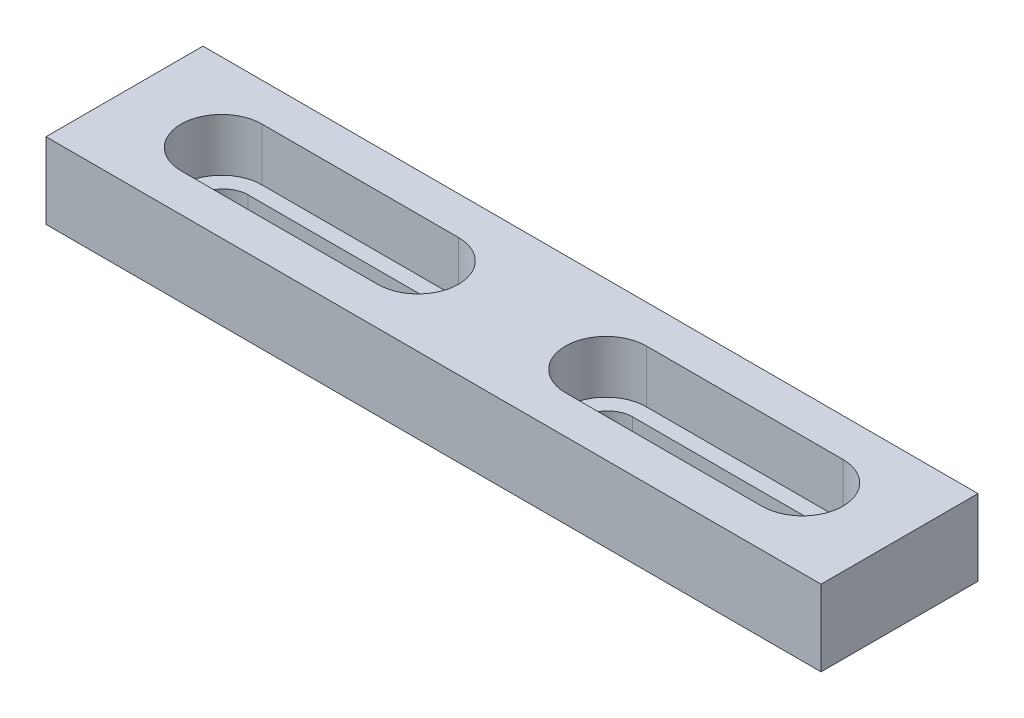
ISO-10303-21;
HEADER;
FILE_DESCRIPTION(('STEP AP214'),'2;1');
FILE_NAME('part.step','',(''),(''),'','','');
FILE_SCHEMA(('AUTOMOTIVE_DESIGN { 1 0 10303 214 1 1 1 1 }'));
ENDSEC;
DATA;
#1=APPLICATION_CONTEXT('core data for automotive mechanical design processes');
#2=APPLICATION_PROTOCOL_DEFINITION('international standard','automotive_design',2000,#1);
#3=PRODUCT_CONTEXT('',#1,'mechanical');
#4=PRODUCT('Part','Part','',(#3));
#5=PRODUCT_RELATED_PRODUCT_CATEGORY('part','',(#4));
#6=PRODUCT_DEFINITION_FORMATION('','',#4);
#7=PRODUCT_DEFINITION_CONTEXT('part definition',#1,'design');
#8=PRODUCT_DEFINITION('design','',#6,#7);
#9=PRODUCT_DEFINITION_SHAPE('','',#8);
#10=(LENGTH_UNIT() NAMED_UNIT(*) SI_UNIT(.MILLI.,.METRE.));
#11=(NAMED_UNIT(*) PLANE_ANGLE_UNIT() SI_UNIT($,.RADIAN.));
#12=(NAMED_UNIT(*) SI_UNIT($,.STERADIAN.) SOLID_ANGLE_UNIT());
#13=UNCERTAINTY_MEASURE_WITH_UNIT(LENGTH_MEASURE(1.E-05),#10,'distance_accuracy_value','');
#14=(GEOMETRIC_REPRESENTATION_CONTEXT(3) GLOBAL_UNCERTAINTY_ASSIGNED_CONTEXT((#13)) GLOBAL_UNIT_ASSIGNED_CONTEXT((#10,
#11,#12)) REPRESENTATION_CONTEXT('',''));
#15=CARTESIAN_POINT('',(0.,0.,0.));
#16=DIRECTION('',(0.,0.,1.));
#17=DIRECTION('',(1.,0.,0.));
#18=AXIS2_PLACEMENT_3D('',#15,#16,#17);
#19=CARTESIAN_POINT('',(12.1249999999999,9.8,1.66190792266419E-13));
#20=DIRECTION('',(0.,-1.,0.));
#21=DIRECTION('',(0.,0.,-1.));
#22=AXIS2_PLACEMENT_3D('',#19,#20,#21);
#23=CYLINDRICAL_SURFACE('',#22,5.225);
#24=CARTESIAN_POINT('',(12.1249999999999,3.,1.66190792266419E-13));
#25=DIRECTION('',(0.,-1.,0.));
#26=DIRECTION('',(0.,0.,-1.));
#27=AXIS2_PLACEMENT_3D('',#24,#25,#26);
#28=CIRCLE('',#27,5.225);
#29=CARTESIAN_POINT('',(12.125,3.,-5.22499999999984));
#30=VERTEX_POINT('',#29);
#31=CARTESIAN_POINT('',(12.1249999999999,3.,5.22500000000017));
#32=VERTEX_POINT('',#31);
#33=EDGE_CURVE('E180',#30,#32,#28,.F.);
#34=ORIENTED_EDGE('',*,*,#33,.F.);
#35=DIRECTION('',(0.,-1.,0.));
#36=VECTOR('',#35,1.);
#37=CARTESIAN_POINT('',(12.125,9.8,-5.22499999999984));
#38=LINE('',#37,#36);
#39=CARTESIAN_POINT('',(12.125,9.8,-5.22499999999984));
#40=VERTEX_POINT('',#39);
#41=EDGE_CURVE('E192',#40,#30,#38,.T.);
#42=ORIENTED_EDGE('',*,*,#41,.F.);
#43=CARTESIAN_POINT('',(12.1249999999999,9.8,1.66190792266419E-13));
#44=DIRECTION('',(0.,1.,0.));
#45=DIRECTION('',(0.,0.,1.));
#46=AXIS2_PLACEMENT_3D('',#43,#44,#45);
#47=CIRCLE('',#46,5.225);
#48=CARTESIAN_POINT('',(12.1249999999999,9.8,5.22500000000017));
#49=VERTEX_POINT('',#48);
#50=EDGE_CURVE('E346',#49,#40,#47,.F.);
#51=ORIENTED_EDGE('',*,*,#50,.F.);
#52=DIRECTION('',(0.,-1.,0.));
#53=VECTOR('',#52,1.);
#54=CARTESIAN_POINT('',(12.1249999999999,9.8,5.22500000000017));
#55=LINE('',#54,#53);
#56=EDGE_CURVE('E194',#49,#32,#55,.T.);
#57=ORIENTED_EDGE('',*,*,#56,.T.);
#58=EDGE_LOOP('',(#34,#42,#51,#57));
#59=FACE_BOUND('',#58,.T.);
#60=ADVANCED_FACE('F41',(#59),#23,.F.);
#61=CARTESIAN_POINT('',(0.,9.8,5.225));
#62=DIRECTION('',(0.,0.,1.));
#63=DIRECTION('',(1.,0.,0.));
#64=AXIS2_PLACEMENT_3D('',#61,#62,#63);
#65=PLANE('',#64);
#66=DIRECTION('',(1.,0.,0.));
#67=VECTOR('',#66,1.);
#68=CARTESIAN_POINT('',(0.,3.,5.225));
#69=LINE('',#68,#67);
#70=CARTESIAN_POINT('',(37.4749999999999,3.,5.22500000000052));
#71=VERTEX_POINT('',#70);
#72=EDGE_CURVE('E340',#32,#71,#69,.T.);
#73=ORIENTED_EDGE('',*,*,#72,.F.);
#74=ORIENTED_EDGE('',*,*,#56,.F.);
#75=DIRECTION('',(-1.,0.,0.));
#76=VECTOR('',#75,1.);
#77=CARTESIAN_POINT('',(0.,9.8,5.225));
#78=LINE('',#77,#76);
#79=CARTESIAN_POINT('',(37.4749999999999,9.8,5.22500000000052));
#80=VERTEX_POINT('',#79);
#81=EDGE_CURVE('E343',#80,#49,#78,.T.);
#82=ORIENTED_EDGE('',*,*,#81,.F.);
#83=DIRECTION('',(0.,-1.,0.));
#84=VECTOR('',#83,1.);
#85=CARTESIAN_POINT('',(37.4749999999999,9.8,5.22500000000052));
#86=LINE('',#85,#84);
#87=EDGE_CURVE('E206',#80,#71,#86,.T.);
#88=ORIENTED_EDGE('',*,*,#87,.T.);
#89=EDGE_LOOP('',(#73,#74,#82,#88));
#90=FACE_BOUND('',#89,.T.);
#91=ADVANCED_FACE('F284',(#90),#65,.F.);
#92=CARTESIAN_POINT('',(37.4749999999999,9.8,5.1364947960281E-13));
#93=DIRECTION('',(0.,-1.,0.));
#94=DIRECTION('',(0.,0.,-1.));
#95=AXIS2_PLACEMENT_3D('',#92,#93,#94);
#96=CYLINDRICAL_SURFACE('',#95,5.225);
#97=CARTESIAN_POINT('',(37.4749999999999,3.,5.1364947960281E-13));
#98=DIRECTION('',(0.,-1.,0.));
#99=DIRECTION('',(0.,0.,-1.));
#100=AXIS2_PLACEMENT_3D('',#97,#98,#99);
#101=CIRCLE('',#100,5.225);
#102=CARTESIAN_POINT('',(37.475,3.,-5.22499999999949));
#103=VERTEX_POINT('',#102);
#104=EDGE_CURVE('E57',#71,#103,#101,.F.);
#105=ORIENTED_EDGE('',*,*,#104,.F.);
#106=ORIENTED_EDGE('',*,*,#87,.F.);
#107=CARTESIAN_POINT('',(37.4749999999999,9.8,5.1364947960281E-13));
#108=DIRECTION('',(0.,1.,0.));
#109=DIRECTION('',(0.,0.,1.));
#110=AXIS2_PLACEMENT_3D('',#107,#108,#109);
#111=CIRCLE('',#110,5.225);
#112=CARTESIAN_POINT('',(37.475,9.8,-5.22499999999949));
#113=VERTEX_POINT('',#112);
#114=EDGE_CURVE('E208',#113,#80,#111,.F.);
#115=ORIENTED_EDGE('',*,*,#114,.F.);
#116=DIRECTION('',(0.,-1.,0.));
#117=VECTOR('',#116,1.);
#118=CARTESIAN_POINT('',(37.475,9.8,-5.22499999999949));
#119=LINE('',#118,#117);
#120=EDGE_CURVE('E202',#113,#103,#119,.T.);
#121=ORIENTED_EDGE('',*,*,#120,.T.);
#122=EDGE_LOOP('',(#105,#106,#115,#121));
#123=FACE_BOUND('',#122,.T.);
#124=ADVANCED_FACE('F289',(#123),#96,.F.);
#125=CARTESIAN_POINT('',(0.,9.8,-5.225));
#126=DIRECTION('',(0.,0.,1.));
#127=DIRECTION('',(1.,0.,0.));
#128=AXIS2_PLACEMENT_3D('',#125,#126,#127);
#129=PLANE('',#128);
#130=ORIENTED_EDGE('',*,*,#41,.T.);
#131=DIRECTION('',(-1.,0.,0.));
#132=VECTOR('',#131,1.);
#133=CARTESIAN_POINT('',(0.,3.,-5.225));
#134=LINE('',#133,#132);
#135=EDGE_CURVE('E176',#103,#30,#134,.T.);
#136=ORIENTED_EDGE('',*,*,#135,.F.);
#137=ORIENTED_EDGE('',*,*,#120,.F.);
#138=DIRECTION('',(-1.,0.,0.));
#139=VECTOR('',#138,1.);
#140=CARTESIAN_POINT('',(0.,9.8,-5.225));
#141=LINE('',#140,#139);
#142=EDGE_CURVE('E200',#113,#40,#141,.T.);
#143=ORIENTED_EDGE('',*,*,#142,.T.);
#144=EDGE_LOOP('',(#130,#136,#137,#143));
#145=FACE_BOUND('',#144,.T.);
#146=ADVANCED_FACE('F198',(#145),#129,.T.);
#147=CARTESIAN_POINT('',(0.,9.8,5.225));
#148=DIRECTION('',(0.,0.,-1.));
#149=DIRECTION('',(-1.,0.,0.));
#150=AXIS2_PLACEMENT_3D('',#147,#148,#149);
#151=PLANE('',#150);
#152=DIRECTION('',(0.,-1.,0.));
#153=VECTOR('',#152,1.);
#154=CARTESIAN_POINT('',(-12.1249999999999,9.8,5.225));
#155=LINE('',#154,#153);
#156=CARTESIAN_POINT('',(-12.1249999999999,9.8,5.225));
#157=VERTEX_POINT('',#156);
#158=CARTESIAN_POINT('',(-12.1249999999999,3.,5.225));
#159=VERTEX_POINT('',#158);
#160=EDGE_CURVE('E238',#157,#159,#155,.T.);
#161=ORIENTED_EDGE('',*,*,#160,.T.);
#162=DIRECTION('',(1.,0.,0.));
#163=VECTOR('',#162,1.);
#164=CARTESIAN_POINT('',(0.,3.,5.225));
#165=LINE('',#164,#163);
#166=CARTESIAN_POINT('',(-37.4749999999999,3.,5.225));
#167=VERTEX_POINT('',#166);
#168=EDGE_CURVE('E418',#167,#159,#165,.T.);
#169=ORIENTED_EDGE('',*,*,#168,.F.);
#170=DIRECTION('',(0.,-1.,0.));
#171=VECTOR('',#170,1.);
#172=CARTESIAN_POINT('',(-37.4749999999999,9.8,5.225));
#173=LINE('',#172,#171);
#174=CARTESIAN_POINT('',(-37.4749999999999,9.8,5.225));
#175=VERTEX_POINT('',#174);
#176=EDGE_CURVE('E365',#175,#167,#173,.T.);
#177=ORIENTED_EDGE('',*,*,#176,.F.);
#178=DIRECTION('',(1.,0.,0.));
#179=VECTOR('',#178,1.);
#180=CARTESIAN_POINT('',(0.,9.8,5.225));
#181=LINE('',#180,#179);
#182=EDGE_CURVE('E217',#175,#157,#181,.T.);
#183=ORIENTED_EDGE('',*,*,#182,.T.);
#184=EDGE_LOOP('',(#161,#169,#177,#183));
#185=FACE_BOUND('',#184,.T.);
#186=ADVANCED_FACE('F328',(#185),#151,.T.);
#187=CARTESIAN_POINT('',(-12.1249999999999,9.8,0.));
#188=DIRECTION('',(0.,-1.,0.));
#189=DIRECTION('',(0.,0.,-1.));
#190=AXIS2_PLACEMENT_3D('',#187,#188,#189);
#191=CYLINDRICAL_SURFACE('',#190,5.225);
#192=DIRECTION('',(0.,-1.,0.));
#193=VECTOR('',#192,1.);
#194=CARTESIAN_POINT('',(-12.1249999999999,9.8,-5.225));
#195=LINE('',#194,#193);
#196=CARTESIAN_POINT('',(-12.1249999999999,9.8,-5.225));
#197=VERTEX_POINT('',#196);
#198=CARTESIAN_POINT('',(-12.1249999999999,3.,-5.225));
#199=VERTEX_POINT('',#198);
#200=EDGE_CURVE('E357',#197,#199,#195,.T.);
#201=ORIENTED_EDGE('',*,*,#200,.T.);
#202=CARTESIAN_POINT('',(-12.1249999999999,3.,0.));
#203=DIRECTION('',(0.,-1.,0.));
#204=DIRECTION('',(0.,0.,-1.));
#205=AXIS2_PLACEMENT_3D('',#202,#203,#204);
#206=CIRCLE('',#205,5.225);
#207=EDGE_CURVE('E385',#159,#199,#206,.F.);
#208=ORIENTED_EDGE('',*,*,#207,.F.);
#209=ORIENTED_EDGE('',*,*,#160,.F.);
#210=CARTESIAN_POINT('',(-12.1249999999999,9.8,0.));
#211=DIRECTION('',(0.,1.,0.));
#212=DIRECTION('',(0.,0.,1.));
#213=AXIS2_PLACEMENT_3D('',#210,#211,#212);
#214=CIRCLE('',#213,5.225);
#215=EDGE_CURVE('E376',#157,#197,#214,.T.);
#216=ORIENTED_EDGE('',*,*,#215,.T.);
#217=EDGE_LOOP('',(#201,#208,#209,#216));
#218=FACE_BOUND('',#217,.T.);
#219=ADVANCED_FACE('F324',(#218),#191,.F.);
#220=CARTESIAN_POINT('',(0.,9.8,-5.225));
#221=DIRECTION('',(0.,0.,-1.));
#222=DIRECTION('',(-1.,0.,0.));
#223=AXIS2_PLACEMENT_3D('',#220,#221,#222);
#224=PLANE('',#223);
#225=DIRECTION('',(-1.,0.,0.));
#226=VECTOR('',#225,1.);
#227=CARTESIAN_POINT('',(0.,3.,-5.225));
#228=LINE('',#227,#226);
#229=CARTESIAN_POINT('',(-37.4749999999999,3.,-5.225));
#230=VERTEX_POINT('',#229);
#231=EDGE_CURVE('E65',#199,#230,#228,.T.);
#232=ORIENTED_EDGE('',*,*,#231,.F.);
#233=ORIENTED_EDGE('',*,*,#200,.F.);
#234=DIRECTION('',(1.,0.,0.));
#235=VECTOR('',#234,1.);
#236=CARTESIAN_POINT('',(0.,9.8,-5.225));
#237=LINE('',#236,#235);
#238=CARTESIAN_POINT('',(-37.4749999999999,9.8,-5.225));
#239=VERTEX_POINT('',#238);
#240=EDGE_CURVE('E372',#239,#197,#237,.T.);
#241=ORIENTED_EDGE('',*,*,#240,.F.);
#242=DIRECTION('',(0.,-1.,0.));
#243=VECTOR('',#242,1.);
#244=CARTESIAN_POINT('',(-37.4749999999999,9.8,-5.225));
#245=LINE('',#244,#243);
#246=EDGE_CURVE('E361',#239,#230,#245,.T.);
#247=ORIENTED_EDGE('',*,*,#246,.T.);
#248=EDGE_LOOP('',(#232,#233,#241,#247));
#249=FACE_BOUND('',#248,.T.);
#250=ADVANCED_FACE('F320',(#249),#224,.F.);
#251=CARTESIAN_POINT('',(-37.4749999999999,9.8,0.));
#252=DIRECTION('',(0.,-1.,0.));
#253=DIRECTION('',(0.,0.,-1.));
#254=AXIS2_PLACEMENT_3D('',#251,#252,#253);
#255=CYLINDRICAL_SURFACE('',#254,5.225);
#256=ORIENTED_EDGE('',*,*,#176,.T.);
#257=CARTESIAN_POINT('',(-37.4749999999999,3.,0.));
#258=DIRECTION('',(0.,-1.,0.));
#259=DIRECTION('',(0.,0.,-1.));
#260=AXIS2_PLACEMENT_3D('',#257,#258,#259);
#261=CIRCLE('',#260,5.225);
#262=EDGE_CURVE('E415',#230,#167,#261,.F.);
#263=ORIENTED_EDGE('',*,*,#262,.F.);
#264=ORIENTED_EDGE('',*,*,#246,.F.);
#265=CARTESIAN_POINT('',(-37.4749999999999,9.8,0.));
#266=DIRECTION('',(0.,1.,0.));
#267=DIRECTION('',(0.,0.,1.));
#268=AXIS2_PLACEMENT_3D('',#265,#266,#267);
#269=CIRCLE('',#268,5.225);
#270=EDGE_CURVE('E369',#239,#175,#269,.T.);
#271=ORIENTED_EDGE('',*,*,#270,.T.);
#272=EDGE_LOOP('',(#256,#263,#264,#271));
#273=FACE_BOUND('',#272,.T.);
#274=ADVANCED_FACE('F296',(#273),#255,.F.);
#275=CARTESIAN_POINT('',(0.,9.8,0.));
#276=DIRECTION('',(0.,-1.,0.));
#277=DIRECTION('',(0.,0.,-1.));
#278=AXIS2_PLACEMENT_3D('',#275,#276,#277);
#279=PLANE('',#278);
#280=DIRECTION('',(0.,0.,-1.));
#281=VECTOR('',#280,1.);
#282=CARTESIAN_POINT('',(50.,9.8,10.125));
#283=LINE('',#282,#281);
#284=CARTESIAN_POINT('',(50.,9.8,10.125));
#285=VERTEX_POINT('',#284);
#286=CARTESIAN_POINT('',(50.,9.8,-10.125));
#287=VERTEX_POINT('',#286);
#288=EDGE_CURVE('E218',#285,#287,#283,.T.);
#289=ORIENTED_EDGE('',*,*,#288,.T.);
#290=DIRECTION('',(-1.,0.,0.));
#291=VECTOR('',#290,1.);
#292=CARTESIAN_POINT('',(-49.9999999999999,9.8,-10.125));
#293=LINE('',#292,#291);
#294=CARTESIAN_POINT('',(-49.9999999999999,9.8,-10.125));
#295=VERTEX_POINT('',#294);
#296=EDGE_CURVE('E222',#287,#295,#293,.T.);
#297=ORIENTED_EDGE('',*,*,#296,.T.);
#298=DIRECTION('',(0.,0.,1.));
#299=VECTOR('',#298,1.);
#300=CARTESIAN_POINT('',(-49.9999999999999,9.8,10.125));
#301=LINE('',#300,#299);
#302=CARTESIAN_POINT('',(-49.9999999999999,9.8,10.125));
#303=VERTEX_POINT('',#302);
#304=EDGE_CURVE('E226',#295,#303,#301,.T.);
#305=ORIENTED_EDGE('',*,*,#304,.T.);
#306=DIRECTION('',(1.,0.,0.));
#307=VECTOR('',#306,1.);
#308=CARTESIAN_POINT('',(-49.9999999999999,9.8,10.125));
#309=LINE('',#308,#307);
#310=EDGE_CURVE('E229',#303,#285,#309,.T.);
#311=ORIENTED_EDGE('',*,*,#310,.T.);
#312=EDGE_LOOP('',(#289,#297,#305,#311));
#313=FACE_BOUND('',#312,.T.);
#314=ORIENTED_EDGE('',*,*,#81,.T.);
#315=ORIENTED_EDGE('',*,*,#50,.T.);
#316=ORIENTED_EDGE('',*,*,#142,.F.);
#317=ORIENTED_EDGE('',*,*,#114,.T.);
#318=EDGE_LOOP('',(#314,#315,#316,#317));
#319=FACE_BOUND('',#318,.T.);
#320=ORIENTED_EDGE('',*,*,#182,.F.);
#321=ORIENTED_EDGE('',*,*,#270,.F.);
#322=ORIENTED_EDGE('',*,*,#240,.T.);
#323=ORIENTED_EDGE('',*,*,#215,.F.);
#324=EDGE_LOOP('',(#320,#321,#322,#323));
#325=FACE_BOUND('',#324,.T.);
#326=ADVANCED_FACE('F274',(#313,#319,#325),#279,.F.);
#327=CARTESIAN_POINT('',(0.,0.,0.));
#328=DIRECTION('',(0.,-1.,0.));
#329=DIRECTION('',(0.,0.,-1.));
#330=AXIS2_PLACEMENT_3D('',#327,#328,#329);
#331=PLANE('',#330);
#332=DIRECTION('',(0.,0.,-1.));
#333=VECTOR('',#332,1.);
#334=CARTESIAN_POINT('',(50.,0.,10.125));
#335=LINE('',#334,#333);
#336=CARTESIAN_POINT('',(50.,0.,10.125));
#337=VERTEX_POINT('',#336);
#338=CARTESIAN_POINT('',(50.,0.,-10.125));
#339=VERTEX_POINT('',#338);
#340=EDGE_CURVE('E233',#337,#339,#335,.T.);
#341=ORIENTED_EDGE('',*,*,#340,.F.);
#342=DIRECTION('',(1.,0.,0.));
#343=VECTOR('',#342,1.);
#344=CARTESIAN_POINT('',(-49.9999999999999,0.,10.125));
#345=LINE('',#344,#343);
#346=CARTESIAN_POINT('',(-49.9999999999999,0.,10.125));
#347=VERTEX_POINT('',#346);
#348=EDGE_CURVE('E223',#347,#337,#345,.T.);
#349=ORIENTED_EDGE('',*,*,#348,.F.);
#350=DIRECTION('',(0.,0.,1.));
#351=VECTOR('',#350,1.);
#352=CARTESIAN_POINT('',(-49.9999999999999,0.,10.125));
#353=LINE('',#352,#351);
#354=CARTESIAN_POINT('',(-49.9999999999999,0.,-10.125));
#355=VERTEX_POINT('',#354);
#356=EDGE_CURVE('E241',#355,#347,#353,.T.);
#357=ORIENTED_EDGE('',*,*,#356,.F.);
#358=DIRECTION('',(-1.,0.,0.));
#359=VECTOR('',#358,1.);
#360=CARTESIAN_POINT('',(-49.9999999999999,0.,-10.125));
#361=LINE('',#360,#359);
#362=EDGE_CURVE('E237',#339,#355,#361,.T.);
#363=ORIENTED_EDGE('',*,*,#362,.F.);
#364=EDGE_LOOP('',(#341,#349,#357,#363));
#365=FACE_BOUND('',#364,.T.);
#366=CARTESIAN_POINT('',(-37.2499999999999,0.,0.));
#367=DIRECTION('',(0.,-1.,0.));
#368=DIRECTION('',(0.,0.,-1.));
#369=AXIS2_PLACEMENT_3D('',#366,#367,#368);
#370=CIRCLE('',#369,3.215);
#371=CARTESIAN_POINT('',(-37.2499999999999,0.,3.215));
#372=VERTEX_POINT('',#371);
#373=CARTESIAN_POINT('',(-37.2499999999999,0.,-3.215));
#374=VERTEX_POINT('',#373);
#375=EDGE_CURVE('E407',#372,#374,#370,.T.);
#376=ORIENTED_EDGE('',*,*,#375,.F.);
#377=DIRECTION('',(1.,0.,0.));
#378=VECTOR('',#377,1.);
#379=CARTESIAN_POINT('',(0.,0.,3.215));
#380=LINE('',#379,#378);
#381=CARTESIAN_POINT('',(-12.3499999999999,0.,3.215));
#382=VERTEX_POINT('',#381);
#383=EDGE_CURVE('E403',#372,#382,#380,.T.);
#384=ORIENTED_EDGE('',*,*,#383,.T.);
#385=CARTESIAN_POINT('',(-12.3499999999999,0.,0.));
#386=DIRECTION('',(0.,-1.,0.));
#387=DIRECTION('',(0.,0.,-1.));
#388=AXIS2_PLACEMENT_3D('',#385,#386,#387);
#389=CIRCLE('',#388,3.215);
#390=CARTESIAN_POINT('',(-12.3499999999999,0.,-3.215));
#391=VERTEX_POINT('',#390);
#392=EDGE_CURVE('E399',#391,#382,#389,.T.);
#393=ORIENTED_EDGE('',*,*,#392,.F.);
#394=DIRECTION('',(1.,0.,0.));
#395=VECTOR('',#394,1.);
#396=CARTESIAN_POINT('',(0.,0.,-3.215));
#397=LINE('',#396,#395);
#398=EDGE_CURVE('E395',#374,#391,#397,.T.);
#399=ORIENTED_EDGE('',*,*,#398,.F.);
#400=EDGE_LOOP('',(#376,#384,#393,#399));
#401=FACE_BOUND('',#400,.T.);
#402=DIRECTION('',(-1.,0.,0.));
#403=VECTOR('',#402,1.);
#404=CARTESIAN_POINT('',(0.,0.,3.215));
#405=LINE('',#404,#403);
#406=CARTESIAN_POINT('',(37.25,0.,3.21499999999969));
#407=VERTEX_POINT('',#406);
#408=CARTESIAN_POINT('',(12.35,0.,3.21499999999989));
#409=VERTEX_POINT('',#408);
#410=EDGE_CURVE('E457',#407,#409,#405,.T.);
#411=ORIENTED_EDGE('',*,*,#410,.F.);
#412=CARTESIAN_POINT('',(37.2499999999999,0.,-3.06339316053978E-13));
#413=DIRECTION('',(0.,-1.,0.));
#414=DIRECTION('',(0.,0.,-1.));
#415=AXIS2_PLACEMENT_3D('',#412,#413,#414);
#416=CIRCLE('',#415,3.215);
#417=CARTESIAN_POINT('',(37.2499999999999,0.,-3.2150000000003));
#418=VERTEX_POINT('',#417);
#419=EDGE_CURVE('E453',#407,#418,#416,.F.);
#420=ORIENTED_EDGE('',*,*,#419,.T.);
#421=DIRECTION('',(-1.,0.,0.));
#422=VECTOR('',#421,1.);
#423=CARTESIAN_POINT('',(0.,0.,-3.215));
#424=LINE('',#423,#422);
#425=CARTESIAN_POINT('',(12.3499999999999,0.,-3.2150000000001));
#426=VERTEX_POINT('',#425);
#427=EDGE_CURVE('E449',#418,#426,#424,.T.);
#428=ORIENTED_EDGE('',*,*,#427,.T.);
#429=CARTESIAN_POINT('',(12.3499999999999,0.,-1.0156484706756E-13));
#430=DIRECTION('',(0.,-1.,0.));
#431=DIRECTION('',(0.,0.,-1.));
#432=AXIS2_PLACEMENT_3D('',#429,#430,#431);
#433=CIRCLE('',#432,3.215);
#434=EDGE_CURVE('E196',#426,#409,#433,.F.);
#435=ORIENTED_EDGE('',*,*,#434,.T.);
#436=EDGE_LOOP('',(#411,#420,#428,#435));
#437=FACE_BOUND('',#436,.T.);
#438=ADVANCED_FACE('F264',(#365,#401,#437),#331,.T.);
#439=CARTESIAN_POINT('',(50.,9.8,10.125));
#440=DIRECTION('',(-1.,0.,0.));
#441=DIRECTION('',(0.,0.,1.));
#442=AXIS2_PLACEMENT_3D('',#439,#440,#441);
#443=PLANE('',#442);
#444=ORIENTED_EDGE('',*,*,#340,.T.);
#445=DIRECTION('',(0.,-1.,0.));
#446=VECTOR('',#445,1.);
#447=CARTESIAN_POINT('',(50.,9.8,-10.125));
#448=LINE('',#447,#446);
#449=EDGE_CURVE('E11',#287,#339,#448,.T.);
#450=ORIENTED_EDGE('',*,*,#449,.F.);
#451=ORIENTED_EDGE('',*,*,#288,.F.);
#452=DIRECTION('',(0.,-1.,0.));
#453=VECTOR('',#452,1.);
#454=CARTESIAN_POINT('',(50.,9.8,10.125));
#455=LINE('',#454,#453);
#456=EDGE_CURVE('E232',#285,#337,#455,.T.);
#457=ORIENTED_EDGE('',*,*,#456,.T.);
#458=EDGE_LOOP('',(#444,#450,#451,#457));
#459=FACE_BOUND('',#458,.T.);
#460=ADVANCED_FACE('F43',(#459),#443,.F.);
#461=CARTESIAN_POINT('',(-49.9999999999999,9.8,-10.125));
#462=DIRECTION('',(0.,0.,1.));
#463=DIRECTION('',(1.,0.,0.));
#464=AXIS2_PLACEMENT_3D('',#461,#462,#463);
#465=PLANE('',#464);
#466=ORIENTED_EDGE('',*,*,#362,.T.);
#467=DIRECTION('',(0.,-1.,0.));
#468=VECTOR('',#467,1.);
#469=CARTESIAN_POINT('',(-49.9999999999999,9.8,-10.125));
#470=LINE('',#469,#468);
#471=EDGE_CURVE('E50',#295,#355,#470,.T.);
#472=ORIENTED_EDGE('',*,*,#471,.F.);
#473=ORIENTED_EDGE('',*,*,#296,.F.);
#474=ORIENTED_EDGE('',*,*,#449,.T.);
#475=EDGE_LOOP('',(#466,#472,#473,#474));
#476=FACE_BOUND('',#475,.T.);
#477=ADVANCED_FACE('F276',(#476),#465,.F.);
#478=CARTESIAN_POINT('',(-49.9999999999999,9.8,10.125));
#479=DIRECTION('',(1.,0.,0.));
#480=DIRECTION('',(0.,0.,-1.));
#481=AXIS2_PLACEMENT_3D('',#478,#479,#480);
#482=PLANE('',#481);
#483=ORIENTED_EDGE('',*,*,#356,.T.);
#484=DIRECTION('',(0.,-1.,0.));
#485=VECTOR('',#484,1.);
#486=CARTESIAN_POINT('',(-49.9999999999999,9.8,10.125));
#487=LINE('',#486,#485);
#488=EDGE_CURVE('E249',#303,#347,#487,.T.);
#489=ORIENTED_EDGE('',*,*,#488,.F.);
#490=ORIENTED_EDGE('',*,*,#304,.F.);
#491=ORIENTED_EDGE('',*,*,#471,.T.);
#492=EDGE_LOOP('',(#483,#489,#490,#491));
#493=FACE_BOUND('',#492,.T.);
#494=ADVANCED_FACE('F258',(#493),#482,.F.);
#495=CARTESIAN_POINT('',(-49.9999999999999,9.8,10.125));
#496=DIRECTION('',(0.,0.,-1.));
#497=DIRECTION('',(-1.,0.,0.));
#498=AXIS2_PLACEMENT_3D('',#495,#496,#497);
#499=PLANE('',#498);
#500=ORIENTED_EDGE('',*,*,#348,.T.);
#501=ORIENTED_EDGE('',*,*,#456,.F.);
#502=ORIENTED_EDGE('',*,*,#310,.F.);
#503=ORIENTED_EDGE('',*,*,#488,.T.);
#504=EDGE_LOOP('',(#500,#501,#502,#503));
#505=FACE_BOUND('',#504,.T.);
#506=ADVANCED_FACE('F268',(#505),#499,.F.);
#507=CARTESIAN_POINT('',(-37.2499999999999,3.,0.));
#508=DIRECTION('',(0.,-1.,0.));
#509=DIRECTION('',(0.,0.,-1.));
#510=AXIS2_PLACEMENT_3D('',#507,#508,#509);
#511=CYLINDRICAL_SURFACE('',#510,3.215);
#512=ORIENTED_EDGE('',*,*,#375,.T.);
#513=DIRECTION('',(0.,-1.,0.));
#514=VECTOR('',#513,1.);
#515=CARTESIAN_POINT('',(-37.2499999999999,3.,-3.215));
#516=LINE('',#515,#514);
#517=CARTESIAN_POINT('',(-37.2499999999999,3.,-3.215));
#518=VERTEX_POINT('',#517);
#519=EDGE_CURVE('E353',#518,#374,#516,.T.);
#520=ORIENTED_EDGE('',*,*,#519,.F.);
#521=CARTESIAN_POINT('',(-37.2499999999999,3.,0.));
#522=DIRECTION('',(0.,-1.,0.));
#523=DIRECTION('',(0.,0.,-1.));
#524=AXIS2_PLACEMENT_3D('',#521,#522,#523);
#525=CIRCLE('',#524,3.215);
#526=CARTESIAN_POINT('',(-37.2499999999999,3.,3.215));
#527=VERTEX_POINT('',#526);
#528=EDGE_CURVE('E398',#527,#518,#525,.T.);
#529=ORIENTED_EDGE('',*,*,#528,.F.);
#530=DIRECTION('',(0.,-1.,0.));
#531=VECTOR('',#530,1.);
#532=CARTESIAN_POINT('',(-37.2499999999999,3.,3.215));
#533=LINE('',#532,#531);
#534=EDGE_CURVE('E381',#527,#372,#533,.T.);
#535=ORIENTED_EDGE('',*,*,#534,.T.);
#536=EDGE_LOOP('',(#512,#520,#529,#535));
#537=FACE_BOUND('',#536,.T.);
#538=ADVANCED_FACE('F300',(#537),#511,.F.);
#539=CARTESIAN_POINT('',(0.,3.,-3.215));
#540=DIRECTION('',(0.,0.,-1.));
#541=DIRECTION('',(-1.,0.,0.));
#542=AXIS2_PLACEMENT_3D('',#539,#540,#541);
#543=PLANE('',#542);
#544=ORIENTED_EDGE('',*,*,#398,.T.);
#545=DIRECTION('',(0.,-1.,0.));
#546=VECTOR('',#545,1.);
#547=CARTESIAN_POINT('',(-12.3499999999999,3.,-3.215));
#548=LINE('',#547,#546);
#549=CARTESIAN_POINT('',(-12.3499999999999,3.,-3.215));
#550=VERTEX_POINT('',#549);
#551=EDGE_CURVE('E388',#550,#391,#548,.T.);
#552=ORIENTED_EDGE('',*,*,#551,.F.);
#553=DIRECTION('',(1.,0.,0.));
#554=VECTOR('',#553,1.);
#555=CARTESIAN_POINT('',(0.,3.,-3.215));
#556=LINE('',#555,#554);
#557=EDGE_CURVE('E421',#518,#550,#556,.T.);
#558=ORIENTED_EDGE('',*,*,#557,.F.);
#559=ORIENTED_EDGE('',*,*,#519,.T.);
#560=EDGE_LOOP('',(#544,#552,#558,#559));
#561=FACE_BOUND('',#560,.T.);
#562=ADVANCED_FACE('F304',(#561),#543,.F.);
#563=CARTESIAN_POINT('',(-12.3499999999999,3.,0.));
#564=DIRECTION('',(0.,-1.,0.));
#565=DIRECTION('',(0.,0.,-1.));
#566=AXIS2_PLACEMENT_3D('',#563,#564,#565);
#567=CYLINDRICAL_SURFACE('',#566,3.215);
#568=ORIENTED_EDGE('',*,*,#392,.T.);
#569=DIRECTION('',(0.,-1.,0.));
#570=VECTOR('',#569,1.);
#571=CARTESIAN_POINT('',(-12.3499999999999,3.,3.215));
#572=LINE('',#571,#570);
#573=CARTESIAN_POINT('',(-12.3499999999999,3.,3.215));
#574=VERTEX_POINT('',#573);
#575=EDGE_CURVE('E384',#574,#382,#572,.T.);
#576=ORIENTED_EDGE('',*,*,#575,.F.);
#577=CARTESIAN_POINT('',(-12.3499999999999,3.,0.));
#578=DIRECTION('',(0.,-1.,0.));
#579=DIRECTION('',(0.,0.,-1.));
#580=AXIS2_PLACEMENT_3D('',#577,#578,#579);
#581=CIRCLE('',#580,3.215);
#582=EDGE_CURVE('E424',#550,#574,#581,.T.);
#583=ORIENTED_EDGE('',*,*,#582,.F.);
#584=ORIENTED_EDGE('',*,*,#551,.T.);
#585=EDGE_LOOP('',(#568,#576,#583,#584));
#586=FACE_BOUND('',#585,.T.);
#587=ADVANCED_FACE('F310',(#586),#567,.F.);
#588=CARTESIAN_POINT('',(0.,3.,3.215));
#589=DIRECTION('',(0.,0.,-1.));
#590=DIRECTION('',(-1.,0.,0.));
#591=AXIS2_PLACEMENT_3D('',#588,#589,#590);
#592=PLANE('',#591);
#593=ORIENTED_EDGE('',*,*,#383,.F.);
#594=ORIENTED_EDGE('',*,*,#534,.F.);
#595=DIRECTION('',(1.,0.,0.));
#596=VECTOR('',#595,1.);
#597=CARTESIAN_POINT('',(0.,3.,3.215));
#598=LINE('',#597,#596);
#599=EDGE_CURVE('E427',#527,#574,#598,.T.);
#600=ORIENTED_EDGE('',*,*,#599,.T.);
#601=ORIENTED_EDGE('',*,*,#575,.T.);
#602=EDGE_LOOP('',(#593,#594,#600,#601));
#603=FACE_BOUND('',#602,.T.);
#604=ADVANCED_FACE('F316',(#603),#592,.T.);
#605=CARTESIAN_POINT('',(0.,3.,0.));
#606=DIRECTION('',(0.,-1.,0.));
#607=DIRECTION('',(0.,0.,-1.));
#608=AXIS2_PLACEMENT_3D('',#605,#606,#607);
#609=PLANE('',#608);
#610=ORIENTED_EDGE('',*,*,#528,.T.);
#611=ORIENTED_EDGE('',*,*,#557,.T.);
#612=ORIENTED_EDGE('',*,*,#582,.T.);
#613=ORIENTED_EDGE('',*,*,#599,.F.);
#614=EDGE_LOOP('',(#610,#611,#612,#613));
#615=FACE_BOUND('',#614,.T.);
#616=ORIENTED_EDGE('',*,*,#168,.T.);
#617=ORIENTED_EDGE('',*,*,#207,.T.);
#618=ORIENTED_EDGE('',*,*,#231,.T.);
#619=ORIENTED_EDGE('',*,*,#262,.T.);
#620=EDGE_LOOP('',(#616,#617,#618,#619));
#621=FACE_BOUND('',#620,.T.);
#622=ADVANCED_FACE('F506',(#615,#621),#609,.F.);
#623=CARTESIAN_POINT('',(0.,3.,3.215));
#624=DIRECTION('',(0.,0.,1.));
#625=DIRECTION('',(1.,0.,0.));
#626=AXIS2_PLACEMENT_3D('',#623,#624,#625);
#627=PLANE('',#626);
#628=ORIENTED_EDGE('',*,*,#410,.T.);
#629=DIRECTION('',(0.,-1.,0.));
#630=VECTOR('',#629,1.);
#631=CARTESIAN_POINT('',(12.35,3.,3.21499999999989));
#632=LINE('',#631,#630);
#633=CARTESIAN_POINT('',(12.35,3.,3.21499999999989));
#634=VERTEX_POINT('',#633);
#635=EDGE_CURVE('E410',#634,#409,#632,.T.);
#636=ORIENTED_EDGE('',*,*,#635,.F.);
#637=DIRECTION('',(-1.,0.,0.));
#638=VECTOR('',#637,1.);
#639=CARTESIAN_POINT('',(0.,3.,3.215));
#640=LINE('',#639,#638);
#641=CARTESIAN_POINT('',(37.25,3.,3.21499999999969));
#642=VERTEX_POINT('',#641);
#643=EDGE_CURVE('E472',#642,#634,#640,.T.);
#644=ORIENTED_EDGE('',*,*,#643,.F.);
#645=DIRECTION('',(0.,-1.,0.));
#646=VECTOR('',#645,1.);
#647=CARTESIAN_POINT('',(37.25,3.,3.21499999999969));
#648=LINE('',#647,#646);
#649=EDGE_CURVE('E434',#642,#407,#648,.T.);
#650=ORIENTED_EDGE('',*,*,#649,.T.);
#651=EDGE_LOOP('',(#628,#636,#644,#650));
#652=FACE_BOUND('',#651,.T.);
#653=ADVANCED_FACE('F482',(#652),#627,.F.);
#654=CARTESIAN_POINT('',(12.3499999999999,3.,-1.0156484706756E-13));
#655=DIRECTION('',(0.,-1.,0.));
#656=DIRECTION('',(0.,0.,-1.));
#657=AXIS2_PLACEMENT_3D('',#654,#655,#656);
#658=CYLINDRICAL_SURFACE('',#657,3.215);
#659=ORIENTED_EDGE('',*,*,#434,.F.);
#660=DIRECTION('',(0.,-1.,0.));
#661=VECTOR('',#660,1.);
#662=CARTESIAN_POINT('',(12.3499999999999,3.,-3.2150000000001));
#663=LINE('',#662,#661);
#664=CARTESIAN_POINT('',(12.3499999999999,3.,-3.2150000000001));
#665=VERTEX_POINT('',#664);
#666=EDGE_CURVE('E441',#665,#426,#663,.T.);
#667=ORIENTED_EDGE('',*,*,#666,.F.);
#668=CARTESIAN_POINT('',(12.3499999999999,3.,-1.0156484706756E-13));
#669=DIRECTION('',(0.,-1.,0.));
#670=DIRECTION('',(0.,0.,-1.));
#671=AXIS2_PLACEMENT_3D('',#668,#669,#670);
#672=CIRCLE('',#671,3.215);
#673=EDGE_CURVE('E438',#665,#634,#672,.F.);
#674=ORIENTED_EDGE('',*,*,#673,.T.);
#675=ORIENTED_EDGE('',*,*,#635,.T.);
#676=EDGE_LOOP('',(#659,#667,#674,#675));
#677=FACE_BOUND('',#676,.T.);
#678=ADVANCED_FACE('F486',(#677),#658,.F.);
#679=CARTESIAN_POINT('',(0.,3.,-3.215));
#680=DIRECTION('',(0.,0.,1.));
#681=DIRECTION('',(1.,0.,0.));
#682=AXIS2_PLACEMENT_3D('',#679,#680,#681);
#683=PLANE('',#682);
#684=ORIENTED_EDGE('',*,*,#427,.F.);
#685=DIRECTION('',(0.,-1.,0.));
#686=VECTOR('',#685,1.);
#687=CARTESIAN_POINT('',(37.2499999999999,3.,-3.2150000000003));
#688=LINE('',#687,#686);
#689=CARTESIAN_POINT('',(37.2499999999999,3.,-3.2150000000003));
#690=VERTEX_POINT('',#689);
#691=EDGE_CURVE('E437',#690,#418,#688,.T.);
#692=ORIENTED_EDGE('',*,*,#691,.F.);
#693=DIRECTION('',(-1.,0.,0.));
#694=VECTOR('',#693,1.);
#695=CARTESIAN_POINT('',(0.,3.,-3.215));
#696=LINE('',#695,#694);
#697=EDGE_CURVE('E464',#690,#665,#696,.T.);
#698=ORIENTED_EDGE('',*,*,#697,.T.);
#699=ORIENTED_EDGE('',*,*,#666,.T.);
#700=EDGE_LOOP('',(#684,#692,#698,#699));
#701=FACE_BOUND('',#700,.T.);
#702=ADVANCED_FACE('F489',(#701),#683,.T.);
#703=CARTESIAN_POINT('',(37.2499999999999,3.,-3.06339316053978E-13));
#704=DIRECTION('',(0.,-1.,0.));
#705=DIRECTION('',(0.,0.,-1.));
#706=AXIS2_PLACEMENT_3D('',#703,#704,#705);
#707=CYLINDRICAL_SURFACE('',#706,3.215);
#708=ORIENTED_EDGE('',*,*,#419,.F.);
#709=ORIENTED_EDGE('',*,*,#649,.F.);
#710=CARTESIAN_POINT('',(37.2499999999999,3.,-3.06339316053978E-13));
#711=DIRECTION('',(0.,-1.,0.));
#712=DIRECTION('',(0.,0.,-1.));
#713=AXIS2_PLACEMENT_3D('',#710,#711,#712);
#714=CIRCLE('',#713,3.215);
#715=EDGE_CURVE('E468',#642,#690,#714,.F.);
#716=ORIENTED_EDGE('',*,*,#715,.T.);
#717=ORIENTED_EDGE('',*,*,#691,.T.);
#718=EDGE_LOOP('',(#708,#709,#716,#717));
#719=FACE_BOUND('',#718,.T.);
#720=ADVANCED_FACE('F492',(#719),#707,.F.);
#721=CARTESIAN_POINT('',(0.,3.,0.));
#722=DIRECTION('',(0.,-1.,0.));
#723=DIRECTION('',(0.,0.,-1.));
#724=AXIS2_PLACEMENT_3D('',#721,#722,#723);
#725=PLANE('',#724);
#726=ORIENTED_EDGE('',*,*,#33,.T.);
#727=ORIENTED_EDGE('',*,*,#72,.T.);
#728=ORIENTED_EDGE('',*,*,#104,.T.);
#729=ORIENTED_EDGE('',*,*,#135,.T.);
#730=EDGE_LOOP('',(#726,#727,#728,#729));
#731=FACE_BOUND('',#730,.T.);
#732=ORIENTED_EDGE('',*,*,#643,.T.);
#733=ORIENTED_EDGE('',*,*,#673,.F.);
#734=ORIENTED_EDGE('',*,*,#697,.F.);
#735=ORIENTED_EDGE('',*,*,#715,.F.);
#736=EDGE_LOOP('',(#732,#733,#734,#735));
#737=FACE_BOUND('',#736,.T.);
#738=ADVANCED_FACE('F178',(#731,#737),#725,.F.);
#739=CLOSED_SHELL('',(#60,#91,#124,#146,#186,#219,#250,#274,#326,#438,#460,#477,#494,#506,#538,
#562,#587,#604,#622,#653,#678,#702,#720,#738));
#740=MANIFOLD_SOLID_BREP('B2',#739);
#741=ADVANCED_BREP_SHAPE_REPRESENTATION('',(#18,#740),#14);
#742=SHAPE_DEFINITION_REPRESENTATION(#9,#741);
ENDSEC;
END-ISO-10303-21;
